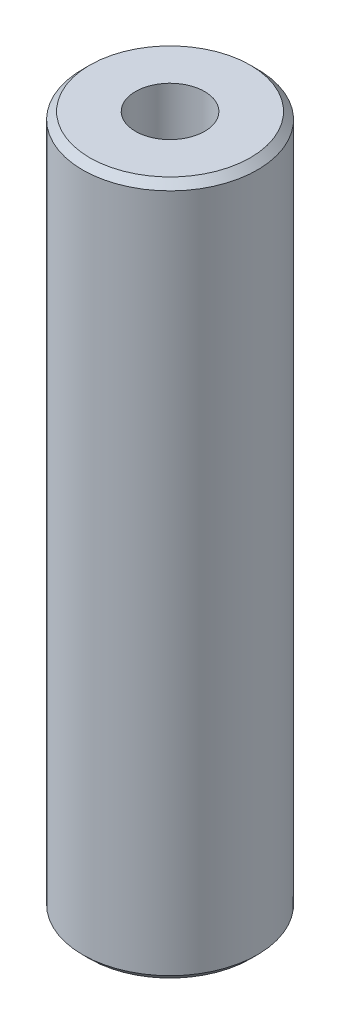
ISO-10303-21;
HEADER;
FILE_DESCRIPTION(('STEP AP214'),'2;1');
FILE_NAME('part.step','',(''),(''),'','','');
FILE_SCHEMA(('AUTOMOTIVE_DESIGN { 1 0 10303 214 1 1 1 1 }'));
ENDSEC;
DATA;
#1=APPLICATION_CONTEXT('core data for automotive mechanical design processes');
#2=APPLICATION_PROTOCOL_DEFINITION('international standard','automotive_design',2000,#1);
#3=PRODUCT_CONTEXT('',#1,'mechanical');
#4=PRODUCT('Part','Part','',(#3));
#5=PRODUCT_RELATED_PRODUCT_CATEGORY('part','',(#4));
#6=PRODUCT_DEFINITION_FORMATION('','',#4);
#7=PRODUCT_DEFINITION_CONTEXT('part definition',#1,'design');
#8=PRODUCT_DEFINITION('design','',#6,#7);
#9=PRODUCT_DEFINITION_SHAPE('','',#8);
#10=(LENGTH_UNIT() NAMED_UNIT(*) SI_UNIT(.MILLI.,.METRE.));
#11=(NAMED_UNIT(*) PLANE_ANGLE_UNIT() SI_UNIT($,.RADIAN.));
#12=(NAMED_UNIT(*) SI_UNIT($,.STERADIAN.) SOLID_ANGLE_UNIT());
#13=UNCERTAINTY_MEASURE_WITH_UNIT(LENGTH_MEASURE(1.E-05),#10,'distance_accuracy_value','');
#14=(GEOMETRIC_REPRESENTATION_CONTEXT(3) GLOBAL_UNCERTAINTY_ASSIGNED_CONTEXT((#13)) GLOBAL_UNIT_ASSIGNED_CONTEXT((#10,
#11,#12)) REPRESENTATION_CONTEXT('',''));
#15=CARTESIAN_POINT('',(0.,0.,0.));
#16=DIRECTION('',(0.,0.,1.));
#17=DIRECTION('',(1.,0.,0.));
#18=AXIS2_PLACEMENT_3D('',#15,#16,#17);
#19=CARTESIAN_POINT('',(0.,337.633012158605,0.));
#20=DIRECTION('',(0.,-1.,0.));
#21=DIRECTION('',(0.,0.,-1.));
#22=AXIS2_PLACEMENT_3D('',#19,#20,#21);
#23=CYLINDRICAL_SURFACE('',#22,42.5);
#24=CARTESIAN_POINT('',(0.,334.196109583922,0.));
#25=DIRECTION('',(0.,1.,0.));
#26=DIRECTION('',(0.,0.,1.));
#27=AXIS2_PLACEMENT_3D('',#24,#25,#26);
#28=CIRCLE('',#27,42.5);
#29=CARTESIAN_POINT('',(0.,334.196109583922,42.5));
#30=VERTEX_POINT('',#29);
#31=EDGE_CURVE('E50',#30,#30,#28,.F.);
#32=ORIENTED_EDGE('',*,*,#31,.T.);
#33=EDGE_LOOP('',(#32));
#34=FACE_BOUND('',#33,.T.);
#35=CARTESIAN_POINT('',(0.,3.43690257468293,0.));
#36=DIRECTION('',(0.,1.,0.));
#37=DIRECTION('',(0.,0.,1.));
#38=AXIS2_PLACEMENT_3D('',#35,#36,#37);
#39=CIRCLE('',#38,42.5);
#40=CARTESIAN_POINT('',(0.,3.43690257468293,42.5));
#41=VERTEX_POINT('',#40);
#42=EDGE_CURVE('E51',#41,#41,#39,.T.);
#43=ORIENTED_EDGE('',*,*,#42,.T.);
#44=EDGE_LOOP('',(#43));
#45=FACE_BOUND('',#44,.T.);
#46=ADVANCED_FACE('F39',(#34,#45),#23,.T.);
#47=CARTESIAN_POINT('',(0.,337.633012158605,0.));
#48=DIRECTION('',(0.,1.,0.));
#49=DIRECTION('',(0.,0.,1.));
#50=AXIS2_PLACEMENT_3D('',#47,#48,#49);
#51=PLANE('',#50);
#52=CARTESIAN_POINT('',(0.,337.633012158605,0.));
#53=DIRECTION('',(0.,1.,0.));
#54=DIRECTION('',(0.,0.,1.));
#55=AXIS2_PLACEMENT_3D('',#52,#53,#54);
#56=CIRCLE('',#55,39.0630974253171);
#57=CARTESIAN_POINT('',(0.,337.633012158605,39.0630974253171));
#58=VERTEX_POINT('',#57);
#59=EDGE_CURVE('E54',#58,#58,#56,.T.);
#60=ORIENTED_EDGE('',*,*,#59,.T.);
#61=EDGE_LOOP('',(#60));
#62=FACE_BOUND('',#61,.T.);
#63=CARTESIAN_POINT('',(0.,337.633012158605,0.));
#64=DIRECTION('',(0.,1.,0.));
#65=DIRECTION('',(0.,0.,1.));
#66=AXIS2_PLACEMENT_3D('',#63,#64,#65);
#67=CIRCLE('',#66,16.8220193100221);
#68=CARTESIAN_POINT('',(0.,337.633012158605,16.8220193100221));
#69=VERTEX_POINT('',#68);
#70=EDGE_CURVE('E58',#69,#69,#67,.T.);
#71=ORIENTED_EDGE('',*,*,#70,.F.);
#72=EDGE_LOOP('',(#71));
#73=FACE_BOUND('',#72,.T.);
#74=ADVANCED_FACE('F69',(#62,#73),#51,.T.);
#75=CARTESIAN_POINT('',(0.,0.,0.));
#76=DIRECTION('',(0.,1.,0.));
#77=DIRECTION('',(0.,0.,1.));
#78=AXIS2_PLACEMENT_3D('',#75,#76,#77);
#79=PLANE('',#78);
#80=CARTESIAN_POINT('',(0.,0.,0.));
#81=DIRECTION('',(0.,1.,0.));
#82=DIRECTION('',(0.,0.,1.));
#83=AXIS2_PLACEMENT_3D('',#80,#81,#82);
#84=CIRCLE('',#83,39.063097425317);
#85=CARTESIAN_POINT('',(0.,0.,39.063097425317));
#86=VERTEX_POINT('',#85);
#87=EDGE_CURVE('E10',#86,#86,#84,.F.);
#88=ORIENTED_EDGE('',*,*,#87,.T.);
#89=EDGE_LOOP('',(#88));
#90=FACE_BOUND('',#89,.T.);
#91=CARTESIAN_POINT('',(0.,0.,0.));
#92=DIRECTION('',(0.,1.,0.));
#93=DIRECTION('',(0.,0.,1.));
#94=AXIS2_PLACEMENT_3D('',#91,#92,#93);
#95=CIRCLE('',#94,16.8220193100221);
#96=CARTESIAN_POINT('',(0.,0.,16.8220193100221));
#97=VERTEX_POINT('',#96);
#98=EDGE_CURVE('E63',#97,#97,#95,.T.);
#99=ORIENTED_EDGE('',*,*,#98,.T.);
#100=EDGE_LOOP('',(#99));
#101=FACE_BOUND('',#100,.T.);
#102=ADVANCED_FACE('F75',(#90,#101),#79,.F.);
#103=CARTESIAN_POINT('',(0.,337.633012158605,0.));
#104=DIRECTION('',(0.,-1.,0.));
#105=DIRECTION('',(0.,0.,-1.));
#106=AXIS2_PLACEMENT_3D('',#103,#104,#105);
#107=CYLINDRICAL_SURFACE('',#106,16.8220193100221);
#108=ORIENTED_EDGE('',*,*,#70,.T.);
#109=EDGE_LOOP('',(#108));
#110=FACE_BOUND('',#109,.T.);
#111=ORIENTED_EDGE('',*,*,#98,.F.);
#112=EDGE_LOOP('',(#111));
#113=FACE_BOUND('',#112,.T.);
#114=ADVANCED_FACE('F70',(#110,#113),#107,.F.);
#115=CARTESIAN_POINT('',(0.,337.633012158605,0.));
#116=DIRECTION('',(0.,-1.,0.));
#117=DIRECTION('',(0.,0.,-1.));
#118=AXIS2_PLACEMENT_3D('',#115,#116,#117);
#119=CONICAL_SURFACE('',#118,39.0630974253171,0.785398163397444);
#120=ORIENTED_EDGE('',*,*,#31,.F.);
#121=EDGE_LOOP('',(#120));
#122=FACE_BOUND('',#121,.T.);
#123=ORIENTED_EDGE('',*,*,#59,.F.);
#124=EDGE_LOOP('',(#123));
#125=FACE_BOUND('',#124,.T.);
#126=ADVANCED_FACE('F81',(#122,#125),#119,.T.);
#127=CARTESIAN_POINT('',(0.,3.43690257468293,0.));
#128=DIRECTION('',(0.,1.,0.));
#129=DIRECTION('',(0.,0.,1.));
#130=AXIS2_PLACEMENT_3D('',#127,#128,#129);
#131=CONICAL_SURFACE('',#130,42.5,0.785398163397456);
#132=ORIENTED_EDGE('',*,*,#87,.F.);
#133=EDGE_LOOP('',(#132));
#134=FACE_BOUND('',#133,.T.);
#135=ORIENTED_EDGE('',*,*,#42,.F.);
#136=EDGE_LOOP('',(#135));
#137=FACE_BOUND('',#136,.T.);
#138=ADVANCED_FACE('F45',(#134,#137),#131,.T.);
#139=CLOSED_SHELL('',(#46,#74,#102,#114,#126,#138));
#140=MANIFOLD_SOLID_BREP('B2',#139);
#141=ADVANCED_BREP_SHAPE_REPRESENTATION('',(#18,#140),#14);
#142=SHAPE_DEFINITION_REPRESENTATION(#9,#141);
ENDSEC;
END-ISO-10303-21;
